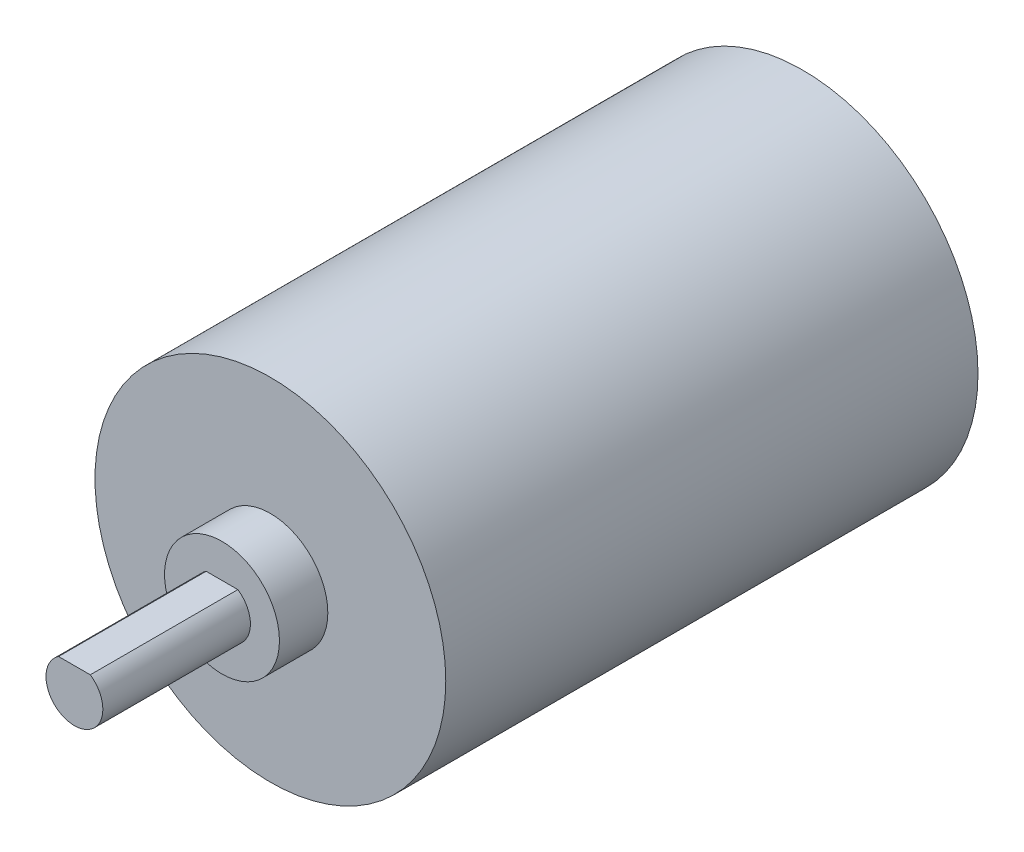
ISO-10303-21;
HEADER;
FILE_DESCRIPTION(('STEP AP214'),'2;1');
FILE_NAME('part.step','',(''),(''),'','','');
FILE_SCHEMA(('AUTOMOTIVE_DESIGN { 1 0 10303 214 1 1 1 1 }'));
ENDSEC;
DATA;
#1=APPLICATION_CONTEXT('core data for automotive mechanical design processes');
#2=APPLICATION_PROTOCOL_DEFINITION('international standard','automotive_design',2000,#1);
#3=PRODUCT_CONTEXT('',#1,'mechanical');
#4=PRODUCT('Part','Part','',(#3));
#5=PRODUCT_RELATED_PRODUCT_CATEGORY('part','',(#4));
#6=PRODUCT_DEFINITION_FORMATION('','',#4);
#7=PRODUCT_DEFINITION_CONTEXT('part definition',#1,'design');
#8=PRODUCT_DEFINITION('design','',#6,#7);
#9=PRODUCT_DEFINITION_SHAPE('','',#8);
#10=(LENGTH_UNIT() NAMED_UNIT(*) SI_UNIT(.MILLI.,.METRE.));
#11=(NAMED_UNIT(*) PLANE_ANGLE_UNIT() SI_UNIT($,.RADIAN.));
#12=(NAMED_UNIT(*) SI_UNIT($,.STERADIAN.) SOLID_ANGLE_UNIT());
#13=UNCERTAINTY_MEASURE_WITH_UNIT(LENGTH_MEASURE(1.E-05),#10,'distance_accuracy_value','');
#14=(GEOMETRIC_REPRESENTATION_CONTEXT(3) GLOBAL_UNCERTAINTY_ASSIGNED_CONTEXT((#13)) GLOBAL_UNIT_ASSIGNED_CONTEXT((#10,
#11,#12)) REPRESENTATION_CONTEXT('',''));
#15=CARTESIAN_POINT('',(0.,0.,0.));
#16=DIRECTION('',(0.,0.,1.));
#17=DIRECTION('',(1.,0.,0.));
#18=AXIS2_PLACEMENT_3D('',#15,#16,#17);
#19=CARTESIAN_POINT('',(0.,0.,-55.88));
#20=DIRECTION('',(0.,0.,1.));
#21=DIRECTION('',(1.,0.,0.));
#22=AXIS2_PLACEMENT_3D('',#19,#20,#21);
#23=CYLINDRICAL_SURFACE('',#22,18.415);
#24=CARTESIAN_POINT('',(0.,0.,-55.88));
#25=DIRECTION('',(0.,0.,1.));
#26=DIRECTION('',(1.,0.,0.));
#27=AXIS2_PLACEMENT_3D('',#24,#25,#26);
#28=CIRCLE('',#27,18.415);
#29=CARTESIAN_POINT('',(18.415,0.,-55.88));
#30=VERTEX_POINT('',#29);
#31=EDGE_CURVE('E43',#30,#30,#28,.T.);
#32=ORIENTED_EDGE('',*,*,#31,.T.);
#33=EDGE_LOOP('',(#32));
#34=FACE_BOUND('',#33,.T.);
#35=CARTESIAN_POINT('',(0.,0.,0.));
#36=DIRECTION('',(0.,0.,1.));
#37=DIRECTION('',(1.,0.,0.));
#38=AXIS2_PLACEMENT_3D('',#35,#36,#37);
#39=CIRCLE('',#38,18.415);
#40=CARTESIAN_POINT('',(18.415,0.,0.));
#41=VERTEX_POINT('',#40);
#42=EDGE_CURVE('E38',#41,#41,#39,.T.);
#43=ORIENTED_EDGE('',*,*,#42,.F.);
#44=EDGE_LOOP('',(#43));
#45=FACE_BOUND('',#44,.T.);
#46=ADVANCED_FACE('F35',(#34,#45),#23,.T.);
#47=CARTESIAN_POINT('',(0.,0.,-55.88));
#48=DIRECTION('',(0.,0.,1.));
#49=DIRECTION('',(1.,0.,0.));
#50=AXIS2_PLACEMENT_3D('',#47,#48,#49);
#51=PLANE('',#50);
#52=ORIENTED_EDGE('',*,*,#31,.F.);
#53=EDGE_LOOP('',(#52));
#54=FACE_BOUND('',#53,.T.);
#55=ADVANCED_FACE('F93',(#54),#51,.F.);
#56=CARTESIAN_POINT('',(0.,0.,0.));
#57=DIRECTION('',(0.,0.,1.));
#58=DIRECTION('',(1.,0.,0.));
#59=AXIS2_PLACEMENT_3D('',#56,#57,#58);
#60=PLANE('',#59);
#61=CARTESIAN_POINT('',(0.,0.,0.));
#62=DIRECTION('',(0.,0.,1.));
#63=DIRECTION('',(1.,0.,0.));
#64=AXIS2_PLACEMENT_3D('',#61,#62,#63);
#65=CIRCLE('',#64,6.0325);
#66=CARTESIAN_POINT('',(6.0325,0.,0.));
#67=VERTEX_POINT('',#66);
#68=EDGE_CURVE('E11',#67,#67,#65,.T.);
#69=ORIENTED_EDGE('',*,*,#68,.F.);
#70=EDGE_LOOP('',(#69));
#71=FACE_BOUND('',#70,.T.);
#72=ORIENTED_EDGE('',*,*,#42,.T.);
#73=EDGE_LOOP('',(#72));
#74=FACE_BOUND('',#73,.T.);
#75=ADVANCED_FACE('F90',(#71,#74),#60,.T.);
#76=CARTESIAN_POINT('',(0.,0.,5.08));
#77=DIRECTION('',(0.,0.,-1.));
#78=DIRECTION('',(-1.,0.,0.));
#79=AXIS2_PLACEMENT_3D('',#76,#77,#78);
#80=CYLINDRICAL_SURFACE('',#79,6.0325);
#81=CARTESIAN_POINT('',(0.,0.,5.08));
#82=DIRECTION('',(0.,0.,1.));
#83=DIRECTION('',(1.,0.,0.));
#84=AXIS2_PLACEMENT_3D('',#81,#82,#83);
#85=CIRCLE('',#84,6.0325);
#86=CARTESIAN_POINT('',(6.0325,0.,5.08));
#87=VERTEX_POINT('',#86);
#88=EDGE_CURVE('E82',#87,#87,#85,.T.);
#89=ORIENTED_EDGE('',*,*,#88,.F.);
#90=EDGE_LOOP('',(#89));
#91=FACE_BOUND('',#90,.T.);
#92=ORIENTED_EDGE('',*,*,#68,.T.);
#93=EDGE_LOOP('',(#92));
#94=FACE_BOUND('',#93,.T.);
#95=ADVANCED_FACE('F102',(#91,#94),#80,.T.);
#96=CARTESIAN_POINT('',(0.,0.,5.08));
#97=DIRECTION('',(0.,0.,1.));
#98=DIRECTION('',(1.,0.,0.));
#99=AXIS2_PLACEMENT_3D('',#96,#97,#98);
#100=PLANE('',#99);
#101=CARTESIAN_POINT('',(0.,0.,5.08));
#102=DIRECTION('',(0.,0.,1.));
#103=DIRECTION('',(1.,0.,0.));
#104=AXIS2_PLACEMENT_3D('',#101,#102,#103);
#105=CIRCLE('',#104,2.9845);
#106=CARTESIAN_POINT('',(-1.66558938517271,2.4765,5.08));
#107=VERTEX_POINT('',#106);
#108=CARTESIAN_POINT('',(1.66558938517271,2.4765,5.08));
#109=VERTEX_POINT('',#108);
#110=EDGE_CURVE('E51',#107,#109,#105,.T.);
#111=ORIENTED_EDGE('',*,*,#110,.F.);
#112=DIRECTION('',(1.,0.,0.));
#113=VECTOR('',#112,1.);
#114=CARTESIAN_POINT('',(-1.66558938517271,2.4765,5.08));
#115=LINE('',#114,#113);
#116=EDGE_CURVE('E71',#107,#109,#115,.T.);
#117=ORIENTED_EDGE('',*,*,#116,.T.);
#118=EDGE_LOOP('',(#111,#117));
#119=FACE_BOUND('',#118,.T.);
#120=ORIENTED_EDGE('',*,*,#88,.T.);
#121=EDGE_LOOP('',(#120));
#122=FACE_BOUND('',#121,.T.);
#123=ADVANCED_FACE('F75',(#119,#122),#100,.T.);
#124=CARTESIAN_POINT('',(0.,0.,20.574));
#125=DIRECTION('',(0.,0.,-1.));
#126=DIRECTION('',(-1.,0.,0.));
#127=AXIS2_PLACEMENT_3D('',#124,#125,#126);
#128=CYLINDRICAL_SURFACE('',#127,2.9845);
#129=ORIENTED_EDGE('',*,*,#110,.T.);
#130=DIRECTION('',(0.,0.,-1.));
#131=VECTOR('',#130,1.);
#132=CARTESIAN_POINT('',(1.66558938517271,2.4765,20.574));
#133=LINE('',#132,#131);
#134=CARTESIAN_POINT('',(1.66558938517271,2.4765,20.574));
#135=VERTEX_POINT('',#134);
#136=EDGE_CURVE('E67',#135,#109,#133,.T.);
#137=ORIENTED_EDGE('',*,*,#136,.F.);
#138=CARTESIAN_POINT('',(0.,0.,20.574));
#139=DIRECTION('',(0.,0.,1.));
#140=DIRECTION('',(1.,0.,0.));
#141=AXIS2_PLACEMENT_3D('',#138,#139,#140);
#142=CIRCLE('',#141,2.9845);
#143=CARTESIAN_POINT('',(-1.66558938517271,2.4765,20.574));
#144=VERTEX_POINT('',#143);
#145=EDGE_CURVE('E65',#144,#135,#142,.T.);
#146=ORIENTED_EDGE('',*,*,#145,.F.);
#147=DIRECTION('',(0.,0.,-1.));
#148=VECTOR('',#147,1.);
#149=CARTESIAN_POINT('',(-1.66558938517271,2.4765,20.574));
#150=LINE('',#149,#148);
#151=EDGE_CURVE('E59',#144,#107,#150,.T.);
#152=ORIENTED_EDGE('',*,*,#151,.T.);
#153=EDGE_LOOP('',(#129,#137,#146,#152));
#154=FACE_BOUND('',#153,.T.);
#155=ADVANCED_FACE('F64',(#154),#128,.T.);
#156=CARTESIAN_POINT('',(-1.66558938517271,2.4765,20.574));
#157=DIRECTION('',(0.,1.,0.));
#158=DIRECTION('',(0.,0.,1.));
#159=AXIS2_PLACEMENT_3D('',#156,#157,#158);
#160=PLANE('',#159);
#161=ORIENTED_EDGE('',*,*,#116,.F.);
#162=ORIENTED_EDGE('',*,*,#151,.F.);
#163=DIRECTION('',(1.,0.,0.));
#164=VECTOR('',#163,1.);
#165=CARTESIAN_POINT('',(-1.66558938517271,2.4765,20.574));
#166=LINE('',#165,#164);
#167=EDGE_CURVE('E68',#144,#135,#166,.T.);
#168=ORIENTED_EDGE('',*,*,#167,.T.);
#169=ORIENTED_EDGE('',*,*,#136,.T.);
#170=EDGE_LOOP('',(#161,#162,#168,#169));
#171=FACE_BOUND('',#170,.T.);
#172=ADVANCED_FACE('F72',(#171),#160,.T.);
#173=CARTESIAN_POINT('',(0.,0.,20.574));
#174=DIRECTION('',(0.,0.,1.));
#175=DIRECTION('',(1.,0.,0.));
#176=AXIS2_PLACEMENT_3D('',#173,#174,#175);
#177=PLANE('',#176);
#178=ORIENTED_EDGE('',*,*,#145,.T.);
#179=ORIENTED_EDGE('',*,*,#167,.F.);
#180=EDGE_LOOP('',(#178,#179));
#181=FACE_BOUND('',#180,.T.);
#182=ADVANCED_FACE('F114',(#181),#177,.T.);
#183=CLOSED_SHELL('',(#46,#55,#75,#95,#123,#155,#172,#182));
#184=MANIFOLD_SOLID_BREP('B2',#183);
#185=ADVANCED_BREP_SHAPE_REPRESENTATION('',(#18,#184),#14);
#186=SHAPE_DEFINITION_REPRESENTATION(#9,#185);
ENDSEC;
END-ISO-10303-21;
